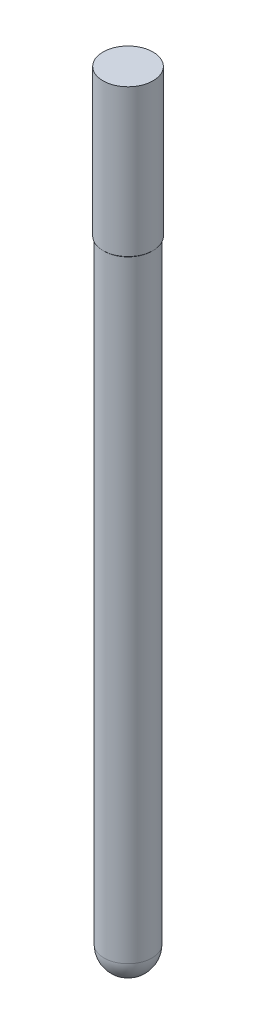
ISO-10303-21;
HEADER;
FILE_DESCRIPTION(('STEP AP214'),'2;1');
FILE_NAME('part.step','',(''),(''),'','','');
FILE_SCHEMA(('AUTOMOTIVE_DESIGN { 1 0 10303 214 1 1 1 1 }'));
ENDSEC;
DATA;
#1=APPLICATION_CONTEXT('core data for automotive mechanical design processes');
#2=APPLICATION_PROTOCOL_DEFINITION('international standard','automotive_design',2000,#1);
#3=PRODUCT_CONTEXT('',#1,'mechanical');
#4=PRODUCT('Part','Part','',(#3));
#5=PRODUCT_RELATED_PRODUCT_CATEGORY('part','',(#4));
#6=PRODUCT_DEFINITION_FORMATION('','',#4);
#7=PRODUCT_DEFINITION_CONTEXT('part definition',#1,'design');
#8=PRODUCT_DEFINITION('design','',#6,#7);
#9=PRODUCT_DEFINITION_SHAPE('','',#8);
#10=(LENGTH_UNIT() NAMED_UNIT(*) SI_UNIT(.MILLI.,.METRE.));
#11=(NAMED_UNIT(*) PLANE_ANGLE_UNIT() SI_UNIT($,.RADIAN.));
#12=(NAMED_UNIT(*) SI_UNIT($,.STERADIAN.) SOLID_ANGLE_UNIT());
#13=UNCERTAINTY_MEASURE_WITH_UNIT(LENGTH_MEASURE(1.E-05),#10,'distance_accuracy_value','');
#14=(GEOMETRIC_REPRESENTATION_CONTEXT(3) GLOBAL_UNCERTAINTY_ASSIGNED_CONTEXT((#13)) GLOBAL_UNIT_ASSIGNED_CONTEXT((#10,
#11,#12)) REPRESENTATION_CONTEXT('',''));
#15=CARTESIAN_POINT('',(0.,0.,0.));
#16=DIRECTION('',(0.,0.,1.));
#17=DIRECTION('',(1.,0.,0.));
#18=AXIS2_PLACEMENT_3D('',#15,#16,#17);
#19=CARTESIAN_POINT('',(0.,2.45000000000001,0.));
#20=DIRECTION('',(0.,-1.,0.));
#21=DIRECTION('',(1.,0.,0.));
#22=AXIS2_PLACEMENT_3D('',#19,#20,#21);
#23=SPHERICAL_SURFACE('',#22,2.45000000000001);
#24=CARTESIAN_POINT('',(0.,2.45000000000001,0.));
#25=DIRECTION('',(0.,-1.,0.));
#26=DIRECTION('',(0.,0.,-1.));
#27=AXIS2_PLACEMENT_3D('',#24,#25,#26);
#28=CIRCLE('',#27,2.45000000000001);
#29=CARTESIAN_POINT('',(0.,2.45000000000001,-2.45000000000001));
#30=VERTEX_POINT('',#29);
#31=EDGE_CURVE('E10',#30,#30,#28,.T.);
#32=ORIENTED_EDGE('',*,*,#31,.T.);
#33=EDGE_LOOP('',(#32));
#34=FACE_BOUND('',#33,.T.);
#35=ADVANCED_FACE('F32',(#34),#23,.T.);
#36=CARTESIAN_POINT('',(0.,0.,0.));
#37=DIRECTION('',(0.,-1.,0.));
#38=DIRECTION('',(0.,0.,-1.));
#39=AXIS2_PLACEMENT_3D('',#36,#37,#38);
#40=CYLINDRICAL_SURFACE('',#39,2.45000000000001);
#41=CARTESIAN_POINT('',(0.,64.9,0.));
#42=DIRECTION('',(0.,-1.,0.));
#43=DIRECTION('',(0.,0.,-1.));
#44=AXIS2_PLACEMENT_3D('',#41,#42,#43);
#45=CIRCLE('',#44,2.45);
#46=CARTESIAN_POINT('',(0.,64.9,-2.45));
#47=VERTEX_POINT('',#46);
#48=EDGE_CURVE('E38',#47,#47,#45,.T.);
#49=ORIENTED_EDGE('',*,*,#48,.T.);
#50=EDGE_LOOP('',(#49));
#51=FACE_BOUND('',#50,.T.);
#52=ORIENTED_EDGE('',*,*,#31,.F.);
#53=EDGE_LOOP('',(#52));
#54=FACE_BOUND('',#53,.T.);
#55=ADVANCED_FACE('F64',(#51,#54),#40,.T.);
#56=CARTESIAN_POINT('',(0.,64.9,0.));
#57=DIRECTION('',(0.,1.,0.));
#58=DIRECTION('',(0.,0.,1.));
#59=AXIS2_PLACEMENT_3D('',#56,#57,#58);
#60=CONICAL_SURFACE('',#59,2.45,0.785398163397429);
#61=CARTESIAN_POINT('',(0.,65.,0.));
#62=DIRECTION('',(0.,-1.,0.));
#63=DIRECTION('',(0.,0.,-1.));
#64=AXIS2_PLACEMENT_3D('',#61,#62,#63);
#65=CIRCLE('',#64,2.55);
#66=CARTESIAN_POINT('',(0.,65.,-2.55));
#67=VERTEX_POINT('',#66);
#68=EDGE_CURVE('E42',#67,#67,#65,.T.);
#69=ORIENTED_EDGE('',*,*,#68,.T.);
#70=EDGE_LOOP('',(#69));
#71=FACE_BOUND('',#70,.T.);
#72=ORIENTED_EDGE('',*,*,#48,.F.);
#73=EDGE_LOOP('',(#72));
#74=FACE_BOUND('',#73,.T.);
#75=ADVANCED_FACE('F61',(#71,#74),#60,.T.);
#76=CARTESIAN_POINT('',(0.,0.,0.));
#77=DIRECTION('',(0.,-1.,0.));
#78=DIRECTION('',(0.,0.,-1.));
#79=AXIS2_PLACEMENT_3D('',#76,#77,#78);
#80=CYLINDRICAL_SURFACE('',#79,2.55);
#81=CARTESIAN_POINT('',(0.,80.,0.));
#82=DIRECTION('',(0.,-1.,0.));
#83=DIRECTION('',(0.,0.,-1.));
#84=AXIS2_PLACEMENT_3D('',#81,#82,#83);
#85=CIRCLE('',#84,2.55);
#86=CARTESIAN_POINT('',(0.,80.,-2.55));
#87=VERTEX_POINT('',#86);
#88=EDGE_CURVE('E46',#87,#87,#85,.T.);
#89=ORIENTED_EDGE('',*,*,#88,.T.);
#90=EDGE_LOOP('',(#89));
#91=FACE_BOUND('',#90,.T.);
#92=ORIENTED_EDGE('',*,*,#68,.F.);
#93=EDGE_LOOP('',(#92));
#94=FACE_BOUND('',#93,.T.);
#95=ADVANCED_FACE('F52',(#91,#94),#80,.T.);
#96=CARTESIAN_POINT('',(0.,80.,0.));
#97=DIRECTION('',(0.,1.,0.));
#98=DIRECTION('',(0.,0.,1.));
#99=AXIS2_PLACEMENT_3D('',#96,#97,#98);
#100=PLANE('',#99);
#101=ORIENTED_EDGE('',*,*,#88,.F.);
#102=EDGE_LOOP('',(#101));
#103=FACE_BOUND('',#102,.T.);
#104=ADVANCED_FACE('F55',(#103),#100,.T.);
#105=CLOSED_SHELL('',(#35,#55,#75,#95,#104));
#106=MANIFOLD_SOLID_BREP('B2',#105);
#107=ADVANCED_BREP_SHAPE_REPRESENTATION('',(#18,#106),#14);
#108=SHAPE_DEFINITION_REPRESENTATION(#9,#107);
ENDSEC;
END-ISO-10303-21;
